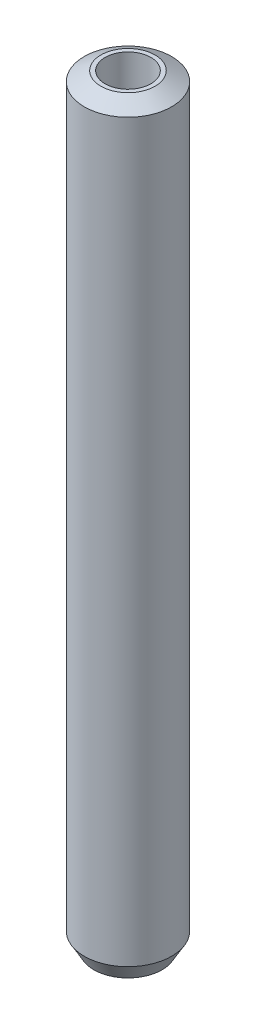
ISO-10303-21;
HEADER;
FILE_DESCRIPTION(('STEP AP214'),'2;1');
FILE_NAME('part.step','',(''),(''),'','','');
FILE_SCHEMA(('AUTOMOTIVE_DESIGN { 1 0 10303 214 1 1 1 1 }'));
ENDSEC;
DATA;
#1=APPLICATION_CONTEXT('core data for automotive mechanical design processes');
#2=APPLICATION_PROTOCOL_DEFINITION('international standard','automotive_design',2000,#1);
#3=PRODUCT_CONTEXT('',#1,'mechanical');
#4=PRODUCT('Part','Part','',(#3));
#5=PRODUCT_RELATED_PRODUCT_CATEGORY('part','',(#4));
#6=PRODUCT_DEFINITION_FORMATION('','',#4);
#7=PRODUCT_DEFINITION_CONTEXT('part definition',#1,'design');
#8=PRODUCT_DEFINITION('design','',#6,#7);
#9=PRODUCT_DEFINITION_SHAPE('','',#8);
#10=(LENGTH_UNIT() NAMED_UNIT(*) SI_UNIT(.MILLI.,.METRE.));
#11=(NAMED_UNIT(*) PLANE_ANGLE_UNIT() SI_UNIT($,.RADIAN.));
#12=(NAMED_UNIT(*) SI_UNIT($,.STERADIAN.) SOLID_ANGLE_UNIT());
#13=UNCERTAINTY_MEASURE_WITH_UNIT(LENGTH_MEASURE(1.E-05),#10,'distance_accuracy_value','');
#14=(GEOMETRIC_REPRESENTATION_CONTEXT(3) GLOBAL_UNCERTAINTY_ASSIGNED_CONTEXT((#13)) GLOBAL_UNIT_ASSIGNED_CONTEXT((#10,
#11,#12)) REPRESENTATION_CONTEXT('',''));
#15=CARTESIAN_POINT('',(0.,0.,0.));
#16=DIRECTION('',(0.,0.,1.));
#17=DIRECTION('',(1.,0.,0.));
#18=AXIS2_PLACEMENT_3D('',#15,#16,#17);
#19=CARTESIAN_POINT('',(0.,174.52471398546,0.));
#20=DIRECTION('',(0.,-1.,0.));
#21=DIRECTION('',(0.,0.,-1.));
#22=AXIS2_PLACEMENT_3D('',#19,#20,#21);
#23=CYLINDRICAL_SURFACE('',#22,10.);
#24=CARTESIAN_POINT('',(0.,172.33510000346,0.));
#25=DIRECTION('',(0.,1.,0.));
#26=DIRECTION('',(0.,0.,1.));
#27=AXIS2_PLACEMENT_3D('',#24,#25,#26);
#28=CIRCLE('',#27,10.);
#29=CARTESIAN_POINT('',(0.,172.33510000346,10.));
#30=VERTEX_POINT('',#29);
#31=EDGE_CURVE('E50',#30,#30,#28,.F.);
#32=ORIENTED_EDGE('',*,*,#31,.T.);
#33=EDGE_LOOP('',(#32));
#34=FACE_BOUND('',#33,.T.);
#35=CARTESIAN_POINT('',(0.,3.79252266578714,0.));
#36=DIRECTION('',(0.,1.,0.));
#37=DIRECTION('',(0.,0.,1.));
#38=AXIS2_PLACEMENT_3D('',#35,#36,#37);
#39=CIRCLE('',#38,10.);
#40=CARTESIAN_POINT('',(0.,3.79252266578714,10.));
#41=VERTEX_POINT('',#40);
#42=EDGE_CURVE('E51',#41,#41,#39,.T.);
#43=ORIENTED_EDGE('',*,*,#42,.T.);
#44=EDGE_LOOP('',(#43));
#45=FACE_BOUND('',#44,.T.);
#46=ADVANCED_FACE('F39',(#34,#45),#23,.T.);
#47=CARTESIAN_POINT('',(0.,174.52471398546,0.));
#48=DIRECTION('',(0.,1.,0.));
#49=DIRECTION('',(0.,0.,1.));
#50=AXIS2_PLACEMENT_3D('',#47,#48,#49);
#51=PLANE('',#50);
#52=CARTESIAN_POINT('',(0.,174.52471398546,0.));
#53=DIRECTION('',(0.,1.,0.));
#54=DIRECTION('',(0.,0.,1.));
#55=AXIS2_PLACEMENT_3D('',#52,#53,#54);
#56=CIRCLE('',#55,6.20747733421281);
#57=CARTESIAN_POINT('',(0.,174.52471398546,6.20747733421281));
#58=VERTEX_POINT('',#57);
#59=EDGE_CURVE('E54',#58,#58,#56,.T.);
#60=ORIENTED_EDGE('',*,*,#59,.T.);
#61=EDGE_LOOP('',(#60));
#62=FACE_BOUND('',#61,.T.);
#63=CARTESIAN_POINT('',(0.,174.52471398546,0.));
#64=DIRECTION('',(0.,1.,0.));
#65=DIRECTION('',(0.,0.,1.));
#66=AXIS2_PLACEMENT_3D('',#63,#64,#65);
#67=CIRCLE('',#66,5.24585519275962);
#68=CARTESIAN_POINT('',(0.,174.52471398546,5.24585519275962));
#69=VERTEX_POINT('',#68);
#70=EDGE_CURVE('E58',#69,#69,#67,.T.);
#71=ORIENTED_EDGE('',*,*,#70,.F.);
#72=EDGE_LOOP('',(#71));
#73=FACE_BOUND('',#72,.T.);
#74=ADVANCED_FACE('F69',(#62,#73),#51,.T.);
#75=CARTESIAN_POINT('',(0.,0.,0.));
#76=DIRECTION('',(0.,1.,0.));
#77=DIRECTION('',(0.,0.,1.));
#78=AXIS2_PLACEMENT_3D('',#75,#76,#77);
#79=PLANE('',#78);
#80=CARTESIAN_POINT('',(0.,0.,0.));
#81=DIRECTION('',(0.,1.,0.));
#82=DIRECTION('',(0.,0.,1.));
#83=AXIS2_PLACEMENT_3D('',#80,#81,#82);
#84=CIRCLE('',#83,7.81038601800004);
#85=CARTESIAN_POINT('',(0.,0.,7.81038601800003));
#86=VERTEX_POINT('',#85);
#87=EDGE_CURVE('E10',#86,#86,#84,.F.);
#88=ORIENTED_EDGE('',*,*,#87,.T.);
#89=EDGE_LOOP('',(#88));
#90=FACE_BOUND('',#89,.T.);
#91=CARTESIAN_POINT('',(0.,0.,0.));
#92=DIRECTION('',(0.,1.,0.));
#93=DIRECTION('',(0.,0.,1.));
#94=AXIS2_PLACEMENT_3D('',#91,#92,#93);
#95=CIRCLE('',#94,5.24585519275962);
#96=CARTESIAN_POINT('',(0.,0.,5.24585519275962));
#97=VERTEX_POINT('',#96);
#98=EDGE_CURVE('E63',#97,#97,#95,.T.);
#99=ORIENTED_EDGE('',*,*,#98,.T.);
#100=EDGE_LOOP('',(#99));
#101=FACE_BOUND('',#100,.T.);
#102=ADVANCED_FACE('F75',(#90,#101),#79,.F.);
#103=CARTESIAN_POINT('',(0.,174.52471398546,0.));
#104=DIRECTION('',(0.,-1.,0.));
#105=DIRECTION('',(0.,0.,-1.));
#106=AXIS2_PLACEMENT_3D('',#103,#104,#105);
#107=CYLINDRICAL_SURFACE('',#106,5.24585519275962);
#108=ORIENTED_EDGE('',*,*,#70,.T.);
#109=EDGE_LOOP('',(#108));
#110=FACE_BOUND('',#109,.T.);
#111=ORIENTED_EDGE('',*,*,#98,.F.);
#112=EDGE_LOOP('',(#111));
#113=FACE_BOUND('',#112,.T.);
#114=ADVANCED_FACE('F70',(#110,#113),#107,.F.);
#115=CARTESIAN_POINT('',(0.,174.52471398546,0.));
#116=DIRECTION('',(0.,-1.,0.));
#117=DIRECTION('',(0.,0.,-1.));
#118=AXIS2_PLACEMENT_3D('',#115,#116,#117);
#119=CONICAL_SURFACE('',#118,6.20747733421281,1.04719755119659);
#120=ORIENTED_EDGE('',*,*,#31,.F.);
#121=EDGE_LOOP('',(#120));
#122=FACE_BOUND('',#121,.T.);
#123=ORIENTED_EDGE('',*,*,#59,.F.);
#124=EDGE_LOOP('',(#123));
#125=FACE_BOUND('',#124,.T.);
#126=ADVANCED_FACE('F81',(#122,#125),#119,.T.);
#127=CARTESIAN_POINT('',(0.,3.79252266578714,0.));
#128=DIRECTION('',(0.,1.,0.));
#129=DIRECTION('',(0.,0.,1.));
#130=AXIS2_PLACEMENT_3D('',#127,#128,#129);
#131=CONICAL_SURFACE('',#130,10.,0.523598775598299);
#132=CARTESIAN_POINT('',(0.,0.,7.81038601800003));
#133=CARTESIAN_POINT('',(0.,0.0395054444352823,7.8331944969792));
#134=CARTESIAN_POINT('',(0.,0.079010888870565,7.85600297595837));
#135=CARTESIAN_POINT('',(0.,0.15802177774113,7.9016199339167));
#136=CARTESIAN_POINT('',(0.,0.197527222176413,7.92442841289587));
#137=CARTESIAN_POINT('',(0.,0.276538111046979,7.9700453708542));
#138=CARTESIAN_POINT('',(0.,0.316043555482261,7.99285384983336));
#139=CARTESIAN_POINT('',(0.,0.395054444352827,8.0384708077917));
#140=CARTESIAN_POINT('',(0.,0.434559888788109,8.06127928677086));
#141=CARTESIAN_POINT('',(0.,0.513570777658675,8.1068962447292));
#142=CARTESIAN_POINT('',(0.,0.553076222093957,8.12970472370836));
#143=CARTESIAN_POINT('',(0.,0.632087110964523,8.17532168166669));
#144=CARTESIAN_POINT('',(0.,0.671592555399806,8.19813016064586));
#145=CARTESIAN_POINT('',(0.,0.750603444270371,8.24374711860419));
#146=CARTESIAN_POINT('',(0.,0.790108888705654,8.26655559758336));
#147=CARTESIAN_POINT('',(0.,0.869119777576219,8.31217255554169));
#148=CARTESIAN_POINT('',(0.,0.908625222011502,8.33498103452086));
#149=CARTESIAN_POINT('',(0.,0.987636110882067,8.38059799247919));
#150=CARTESIAN_POINT('',(0.,1.02714155531735,8.40340647145836));
#151=CARTESIAN_POINT('',(0.,1.10615244418792,8.44902342941669));
#152=CARTESIAN_POINT('',(0.,1.1456578886232,8.47183190839586));
#153=CARTESIAN_POINT('',(0.,1.22466877749376,8.51744886635419));
#154=CARTESIAN_POINT('',(0.,1.26417422192905,8.54025734533336));
#155=CARTESIAN_POINT('',(0.,1.34318511079961,8.58587430329169));
#156=CARTESIAN_POINT('',(0.,1.38269055523489,8.60868278227086));
#157=CARTESIAN_POINT('',(0.,1.46170144410546,8.65429974022919));
#158=CARTESIAN_POINT('',(0.,1.50120688854074,8.67710821920835));
#159=CARTESIAN_POINT('',(0.,1.58021777741131,8.72272517716669));
#160=CARTESIAN_POINT('',(0.,1.61972322184659,8.74553365614585));
#161=CARTESIAN_POINT('',(0.,1.69873411071716,8.79115061410418));
#162=CARTESIAN_POINT('',(0.,1.73823955515244,8.81395909308335));
#163=CARTESIAN_POINT('',(0.,1.817250444023,8.85957605104168));
#164=CARTESIAN_POINT('',(0.,1.85675588845829,8.88238453002085));
#165=CARTESIAN_POINT('',(0.,1.93576677732885,8.92800148797918));
#166=CARTESIAN_POINT('',(0.,1.97527222176414,8.95080996695835));
#167=CARTESIAN_POINT('',(0.,2.0542831106347,8.99642692491668));
#168=CARTESIAN_POINT('',(0.,2.09378855506998,9.01923540389585));
#169=CARTESIAN_POINT('',(0.,2.17279944394055,9.06485236185418));
#170=CARTESIAN_POINT('',(0.,2.21230488837583,9.08766084083335));
#171=CARTESIAN_POINT('',(0.,2.2913157772464,9.13327779879168));
#172=CARTESIAN_POINT('',(0.,2.33082122168168,9.15608627777085));
#173=CARTESIAN_POINT('',(0.,2.40983211055225,9.20170323572918));
#174=CARTESIAN_POINT('',(0.,2.44933755498753,9.22451171470835));
#175=CARTESIAN_POINT('',(0.,2.52834844385809,9.27012867266668));
#176=CARTESIAN_POINT('',(0.,2.56785388829338,9.29293715164584));
#177=CARTESIAN_POINT('',(0.,2.64686477716394,9.33855410960418));
#178=CARTESIAN_POINT('',(0.,2.68637022159922,9.36136258858334));
#179=CARTESIAN_POINT('',(0.,2.76538111046979,9.40697954654168));
#180=CARTESIAN_POINT('',(0.,2.80488655490507,9.42978802552084));
#181=CARTESIAN_POINT('',(0.,2.88389744377564,9.47540498347917));
#182=CARTESIAN_POINT('',(0.,2.92340288821092,9.49821346245834));
#183=CARTESIAN_POINT('',(0.,3.00241377708149,9.54383042041667));
#184=CARTESIAN_POINT('',(0.,3.04191922151677,9.56663889939584));
#185=CARTESIAN_POINT('',(0.,3.12093011038733,9.61225585735417));
#186=CARTESIAN_POINT('',(0.,3.16043555482262,9.63506433633334));
#187=CARTESIAN_POINT('',(0.,3.23944644369318,9.68068129429167));
#188=CARTESIAN_POINT('',(0.,3.27895188812846,9.70348977327084));
#189=CARTESIAN_POINT('',(0.,3.35796277699903,9.74910673122917));
#190=CARTESIAN_POINT('',(0.,3.39746822143431,9.77191521020834));
#191=CARTESIAN_POINT('',(0.,3.47647911030488,9.81753216816667));
#192=CARTESIAN_POINT('',(0.,3.51598455474016,9.84034064714584));
#193=CARTESIAN_POINT('',(0.,3.59499544361073,9.88595760510417));
#194=CARTESIAN_POINT('',(0.,3.63450088804601,9.90876608408334));
#195=CARTESIAN_POINT('',(0.,3.71351177691657,9.95438304204167));
#196=CARTESIAN_POINT('',(0.,3.75301722135186,9.97719152102083));
#197=CARTESIAN_POINT('',(0.,3.79252266578714,10.));
#198=B_SPLINE_CURVE_WITH_KNOTS('',3,(#132,#133,#134,#135,#136,#137,#138,#139,#140,#141,#142,
#143,#144,#145,#146,#147,#148,#149,#150,#151,#152,#153,#154,#155,#156,#157,#158,#159,#160,#161,
#162,#163,#164,#165,#166,#167,#168,#169,#170,#171,#172,#173,#174,#175,#176,#177,#178,#179,#180,
#181,#182,#183,#184,#185,#186,#187,#188,#189,#190,#191,#192,#193,#194,#195,#196,#197),
.UNSPECIFIED.,.F.,.F.,(4,2,2,2,2,2,2,2,2,2,2,2,2,2,2,2,2,2,2,2,2,2,2,2,2,2,2,2,2,2,2,2,4),(0.,
0.136850873874998,0.273701747749995,0.410552621624993,0.54740349549999,0.684254369374988,
0.821105243249986,0.957956117124984,1.09480699099998,1.23165786487498,1.36850873874998,
1.50535961262497,1.64221048649997,1.77906136037497,1.91591223424997,2.05276310812496,
2.18961398199996,2.32646485587496,2.46331572974996,2.60016660362496,2.73701747749995,
2.87386835137495,3.01071922524995,3.14757009912495,3.28442097299994,3.42127184687494,
3.55812272074994,3.69497359462494,3.83182446849993,3.96867534237493,4.10552621624993,
4.24237709012493,4.37922796399992),.UNSPECIFIED.);
#199=EDGE_CURVE('BSEAM45',#86,#41,#198,.T.);
#200=ORIENTED_EDGE('',*,*,#87,.F.);
#201=ORIENTED_EDGE('',*,*,#42,.F.);
#202=ORIENTED_EDGE('',*,*,#199,.T.);
#203=ORIENTED_EDGE('',*,*,#199,.F.);
#204=EDGE_LOOP('',(#200,#202,#201,#203));
#205=FACE_BOUND('',#204,.T.);
#206=ADVANCED_FACE('F45',(#205),#131,.T.);
#207=CLOSED_SHELL('',(#46,#74,#102,#114,#126,#206));
#208=MANIFOLD_SOLID_BREP('B2',#207);
#209=ADVANCED_BREP_SHAPE_REPRESENTATION('',(#18,#208),#14);
#210=SHAPE_DEFINITION_REPRESENTATION(#9,#209);
ENDSEC;
END-ISO-10303-21;
